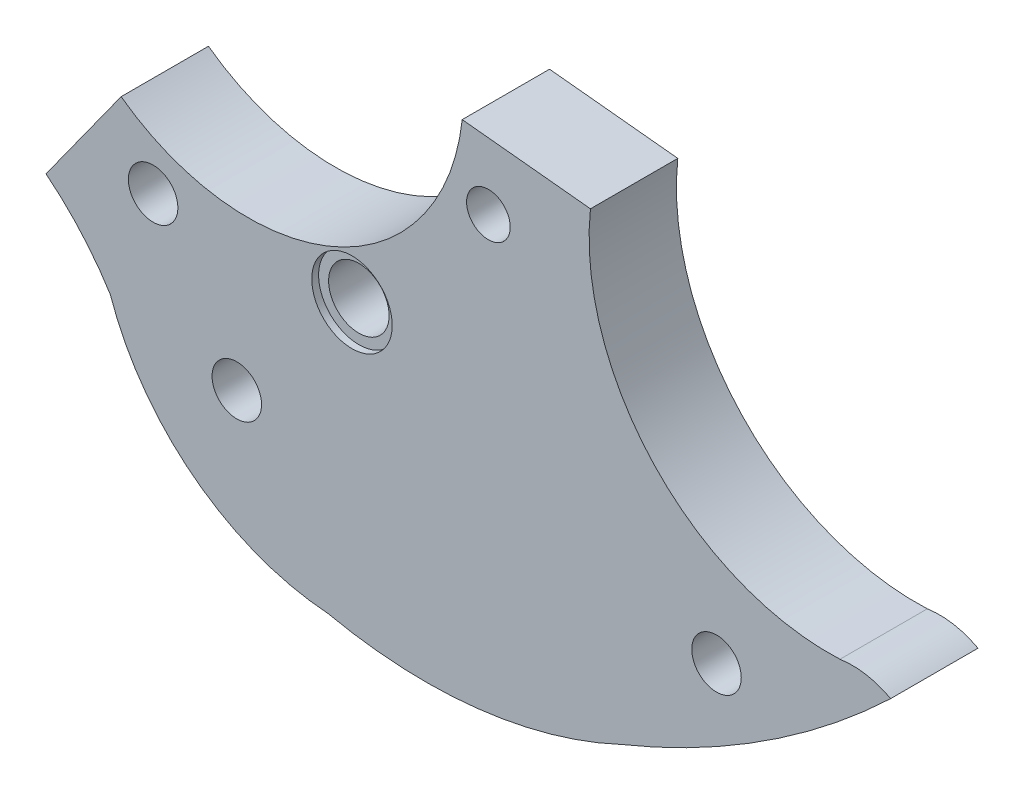
ISO-10303-21;
HEADER;
FILE_DESCRIPTION(('STEP AP214'),'2;1');
FILE_NAME('part.step','',(''),(''),'','','');
FILE_SCHEMA(('AUTOMOTIVE_DESIGN { 1 0 10303 214 1 1 1 1 }'));
ENDSEC;
DATA;
#1=APPLICATION_CONTEXT('core data for automotive mechanical design processes');
#2=APPLICATION_PROTOCOL_DEFINITION('international standard','automotive_design',2000,#1);
#3=PRODUCT_CONTEXT('',#1,'mechanical');
#4=PRODUCT('Part','Part','',(#3));
#5=PRODUCT_RELATED_PRODUCT_CATEGORY('part','',(#4));
#6=PRODUCT_DEFINITION_FORMATION('','',#4);
#7=PRODUCT_DEFINITION_CONTEXT('part definition',#1,'design');
#8=PRODUCT_DEFINITION('design','',#6,#7);
#9=PRODUCT_DEFINITION_SHAPE('','',#8);
#10=(LENGTH_UNIT() NAMED_UNIT(*) SI_UNIT(.MILLI.,.METRE.));
#11=(NAMED_UNIT(*) PLANE_ANGLE_UNIT() SI_UNIT($,.RADIAN.));
#12=(NAMED_UNIT(*) SI_UNIT($,.STERADIAN.) SOLID_ANGLE_UNIT());
#13=UNCERTAINTY_MEASURE_WITH_UNIT(LENGTH_MEASURE(1.E-05),#10,'distance_accuracy_value','');
#14=(GEOMETRIC_REPRESENTATION_CONTEXT(3) GLOBAL_UNCERTAINTY_ASSIGNED_CONTEXT((#13)) GLOBAL_UNIT_ASSIGNED_CONTEXT((#10,
#11,#12)) REPRESENTATION_CONTEXT('',''));
#15=CARTESIAN_POINT('',(0.,0.,0.));
#16=DIRECTION('',(0.,0.,1.));
#17=DIRECTION('',(1.,0.,0.));
#18=AXIS2_PLACEMENT_3D('',#15,#16,#17);
#19=CARTESIAN_POINT('',(52.2343020464871,49.4576694571412,12.7));
#20=DIRECTION('',(0.,0.,-1.));
#21=DIRECTION('',(-1.,0.,0.));
#22=AXIS2_PLACEMENT_3D('',#19,#20,#21);
#23=CYLINDRICAL_SURFACE('',#22,4.4);
#24=CARTESIAN_POINT('',(52.2343020464871,49.4576694571412,0.));
#25=DIRECTION('',(0.,0.,1.));
#26=DIRECTION('',(1.,0.,0.));
#27=AXIS2_PLACEMENT_3D('',#24,#25,#26);
#28=CIRCLE('',#27,4.4);
#29=CARTESIAN_POINT('',(56.6343020464871,49.4576694571412,0.));
#30=VERTEX_POINT('',#29);
#31=EDGE_CURVE('E259',#30,#30,#28,.T.);
#32=ORIENTED_EDGE('',*,*,#31,.F.);
#33=EDGE_LOOP('',(#32));
#34=FACE_BOUND('',#33,.T.);
#35=CARTESIAN_POINT('',(52.2343020464871,49.4576694571412,11.7));
#36=DIRECTION('',(0.,0.,1.));
#37=DIRECTION('',(1.,0.,0.));
#38=AXIS2_PLACEMENT_3D('',#35,#36,#37);
#39=CIRCLE('',#38,4.4);
#40=CARTESIAN_POINT('',(56.6343020464871,49.4576694571412,11.7));
#41=VERTEX_POINT('',#40);
#42=EDGE_CURVE('E43',#41,#41,#39,.T.);
#43=ORIENTED_EDGE('',*,*,#42,.T.);
#44=EDGE_LOOP('',(#43));
#45=FACE_BOUND('',#44,.T.);
#46=ADVANCED_FACE('F39',(#34,#45),#23,.F.);
#47=CARTESIAN_POINT('',(37.1253879159266,83.8639846444566,12.7));
#48=DIRECTION('',(0.,0.,1.));
#49=DIRECTION('',(1.,0.,0.));
#50=AXIS2_PLACEMENT_3D('',#47,#48,#49);
#51=PLANE('',#50);
#52=CARTESIAN_POINT('',(52.2343020464871,49.4576694571412,12.7));
#53=DIRECTION('',(0.,0.,1.));
#54=DIRECTION('',(1.,0.,0.));
#55=AXIS2_PLACEMENT_3D('',#52,#53,#54);
#56=CIRCLE('',#55,5.85);
#57=CARTESIAN_POINT('',(58.0843020464871,49.4576694571412,12.7));
#58=VERTEX_POINT('',#57);
#59=EDGE_CURVE('E266',#58,#58,#56,.T.);
#60=ORIENTED_EDGE('',*,*,#59,.F.);
#61=EDGE_LOOP('',(#60));
#62=FACE_BOUND('',#61,.T.);
#63=CARTESIAN_POINT('',(105.243732184304,30.4641441405667,12.7));
#64=DIRECTION('',(0.,0.,1.));
#65=DIRECTION('',(1.,0.,0.));
#66=AXIS2_PLACEMENT_3D('',#63,#64,#65);
#67=CIRCLE('',#66,3.6);
#68=CARTESIAN_POINT('',(108.843732184304,30.4641441405667,12.7));
#69=VERTEX_POINT('',#68);
#70=EDGE_CURVE('E251',#69,#69,#67,.T.);
#71=ORIENTED_EDGE('',*,*,#70,.F.);
#72=EDGE_LOOP('',(#71));
#73=FACE_BOUND('',#72,.T.);
#74=CARTESIAN_POINT('',(23.3182900497723,48.6789641382707,12.7));
#75=DIRECTION('',(0.,0.,1.));
#76=DIRECTION('',(1.,0.,0.));
#77=AXIS2_PLACEMENT_3D('',#74,#75,#76);
#78=CIRCLE('',#77,3.6);
#79=CARTESIAN_POINT('',(26.9182900497723,48.6789641382707,12.7));
#80=VERTEX_POINT('',#79);
#81=EDGE_CURVE('E235',#80,#80,#78,.T.);
#82=ORIENTED_EDGE('',*,*,#81,.F.);
#83=EDGE_LOOP('',(#82));
#84=FACE_BOUND('',#83,.T.);
#85=CARTESIAN_POINT('',(37.1253879159266,83.8639846444566,12.7));
#86=DIRECTION('',(0.,0.,-1.));
#87=DIRECTION('',(1.,0.,0.));
#88=AXIS2_PLACEMENT_3D('',#85,#86,#87);
#89=CIRCLE('',#88,31.322900316363);
#90=CARTESIAN_POINT('',(68.2640297264696,80.4714825555087,12.7));
#91=VERTEX_POINT('',#90);
#92=CARTESIAN_POINT('',(18.6636008619195,58.5601014839354,12.7));
#93=VERTEX_POINT('',#92);
#94=EDGE_CURVE('E175',#91,#93,#89,.T.);
#95=ORIENTED_EDGE('',*,*,#94,.T.);
#96=DIRECTION('',(-0.584092787225735,-0.811686895244017,0.));
#97=VECTOR('',#96,1.);
#98=CARTESIAN_POINT('',(7.7409802244119,43.3814377046814,12.7));
#99=LINE('',#98,#97);
#100=CARTESIAN_POINT('',(7.7409802244119,43.3814377046814,12.7));
#101=VERTEX_POINT('',#100);
#102=EDGE_CURVE('E104',#93,#101,#99,.T.);
#103=ORIENTED_EDGE('',*,*,#102,.T.);
#104=CARTESIAN_POINT('',(-18.333321031147,10.7859474439337,12.7));
#105=DIRECTION('',(0.,0.,-1.));
#106=DIRECTION('',(1.,0.,0.));
#107=AXIS2_PLACEMENT_3D('',#104,#105,#106);
#108=CIRCLE('',#107,41.7412885678454);
#109=CARTESIAN_POINT('',(17.091631159214,32.8632646182368,12.7));
#110=VERTEX_POINT('',#109);
#111=EDGE_CURVE('E201',#101,#110,#108,.T.);
#112=ORIENTED_EDGE('',*,*,#111,.T.);
#113=CARTESIAN_POINT('',(51.3918564850536,44.6963143264845,12.7));
#114=DIRECTION('',(0.,0.,1.));
#115=DIRECTION('',(1.,0.,0.));
#116=AXIS2_PLACEMENT_3D('',#113,#114,#115);
#117=CIRCLE('',#116,36.2839706041281);
#118=CARTESIAN_POINT('',(48.7852979136686,8.50608946927794,12.7));
#119=VERTEX_POINT('',#118);
#120=EDGE_CURVE('E219',#110,#119,#117,.T.);
#121=ORIENTED_EDGE('',*,*,#120,.T.);
#122=CARTESIAN_POINT('',(62.93038116209,73.9848714735547,12.7));
#123=DIRECTION('',(0.,0.,1.));
#124=DIRECTION('',(1.,0.,0.));
#125=AXIS2_PLACEMENT_3D('',#122,#123,#124);
#126=CIRCLE('',#125,66.9892101227382);
#127=CARTESIAN_POINT('',(91.4216859607616,13.3564967325346,12.7));
#128=VERTEX_POINT('',#127);
#129=EDGE_CURVE('E217',#119,#128,#126,.T.);
#130=ORIENTED_EDGE('',*,*,#129,.T.);
#131=CARTESIAN_POINT('',(44.4653107743594,128.776509479846,12.7));
#132=DIRECTION('',(0.,0.,1.));
#133=DIRECTION('',(1.,0.,0.));
#134=AXIS2_PLACEMENT_3D('',#131,#132,#133);
#135=CIRCLE('',#134,124.606101428605);
#136=CARTESIAN_POINT('',(130.568554451859,38.7048050358374,12.7));
#137=VERTEX_POINT('',#136);
#138=EDGE_CURVE('E127',#128,#137,#135,.T.);
#139=ORIENTED_EDGE('',*,*,#138,.T.);
#140=CARTESIAN_POINT('',(124.978643697181,28.3368703837209,12.7));
#141=DIRECTION('',(0.,0.,1.));
#142=DIRECTION('',(1.,0.,0.));
#143=AXIS2_PLACEMENT_3D('',#140,#141,#142);
#144=CIRCLE('',#143,11.7788442215621);
#145=CARTESIAN_POINT('',(123.199407881085,39.9805592797088,12.7));
#146=VERTEX_POINT('',#145);
#147=EDGE_CURVE('E120',#137,#146,#144,.T.);
#148=ORIENTED_EDGE('',*,*,#147,.T.);
#149=CARTESIAN_POINT('',(121.612132230608,74.842006611136,12.7));
#150=DIRECTION('',(0.,0.,-1.));
#151=DIRECTION('',(1.,0.,0.));
#152=AXIS2_PLACEMENT_3D('',#149,#150,#151);
#153=CIRCLE('',#152,34.8975637263187);
#154=CARTESIAN_POINT('',(86.9137187089322,78.5649158379707,12.7));
#155=VERTEX_POINT('',#154);
#156=EDGE_CURVE('E125',#146,#155,#153,.T.);
#157=ORIENTED_EDGE('',*,*,#156,.T.);
#158=DIRECTION('',(-0.994815069990102,0.101700425370736,0.));
#159=VECTOR('',#158,1.);
#160=CARTESIAN_POINT('',(68.2640297264696,80.4714825555087,12.7));
#161=LINE('',#160,#159);
#162=EDGE_CURVE('E58',#155,#91,#161,.T.);
#163=ORIENTED_EDGE('',*,*,#162,.T.);
#164=EDGE_LOOP('',(#95,#103,#112,#121,#130,#139,#148,#157,#163));
#165=FACE_BOUND('',#164,.T.);
#166=CARTESIAN_POINT('',(72.0734393800084,70.4201259458292,12.7));
#167=DIRECTION('',(0.,0.,1.));
#168=DIRECTION('',(1.,0.,0.));
#169=AXIS2_PLACEMENT_3D('',#166,#167,#168);
#170=CIRCLE('',#169,3.175);
#171=CARTESIAN_POINT('',(75.2484393800084,70.4201259458292,12.7));
#172=VERTEX_POINT('',#171);
#173=EDGE_CURVE('E154',#172,#172,#170,.T.);
#174=ORIENTED_EDGE('',*,*,#173,.F.);
#175=EDGE_LOOP('',(#174));
#176=FACE_BOUND('',#175,.T.);
#177=CARTESIAN_POINT('',(35.4864956833077,29.9885482493761,12.7));
#178=DIRECTION('',(0.,0.,1.));
#179=DIRECTION('',(1.,0.,0.));
#180=AXIS2_PLACEMENT_3D('',#177,#178,#179);
#181=CIRCLE('',#180,3.6);
#182=CARTESIAN_POINT('',(39.0864956833077,29.9885482493761,12.7));
#183=VERTEX_POINT('',#182);
#184=EDGE_CURVE('E243',#183,#183,#181,.T.);
#185=ORIENTED_EDGE('',*,*,#184,.F.);
#186=EDGE_LOOP('',(#185));
#187=FACE_BOUND('',#186,.T.);
#188=ADVANCED_FACE('F122',(#62,#73,#84,#165,#176,#187),#51,.T.);
#189=CARTESIAN_POINT('',(37.1253879159266,83.8639846444566,0.));
#190=DIRECTION('',(0.,0.,1.));
#191=DIRECTION('',(1.,0.,0.));
#192=AXIS2_PLACEMENT_3D('',#189,#190,#191);
#193=PLANE('',#192);
#194=CARTESIAN_POINT('',(37.1253879159266,83.8639846444566,0.));
#195=DIRECTION('',(0.,0.,-1.));
#196=DIRECTION('',(1.,0.,0.));
#197=AXIS2_PLACEMENT_3D('',#194,#195,#196);
#198=CIRCLE('',#197,31.322900316363);
#199=CARTESIAN_POINT('',(68.2640297264696,80.4714825555087,0.));
#200=VERTEX_POINT('',#199);
#201=CARTESIAN_POINT('',(18.6636008619195,58.5601014839354,0.));
#202=VERTEX_POINT('',#201);
#203=EDGE_CURVE('E149',#200,#202,#198,.T.);
#204=ORIENTED_EDGE('',*,*,#203,.F.);
#205=DIRECTION('',(-0.994815069990102,0.101700425370736,0.));
#206=VECTOR('',#205,1.);
#207=CARTESIAN_POINT('',(68.2640297264696,80.4714825555087,0.));
#208=LINE('',#207,#206);
#209=CARTESIAN_POINT('',(86.9137187089322,78.5649158379707,0.));
#210=VERTEX_POINT('',#209);
#211=EDGE_CURVE('E96',#210,#200,#208,.T.);
#212=ORIENTED_EDGE('',*,*,#211,.F.);
#213=CARTESIAN_POINT('',(121.612132230608,74.842006611136,0.));
#214=DIRECTION('',(0.,0.,-1.));
#215=DIRECTION('',(1.,0.,0.));
#216=AXIS2_PLACEMENT_3D('',#213,#214,#215);
#217=CIRCLE('',#216,34.8975637263187);
#218=CARTESIAN_POINT('',(123.199407881085,39.9805592797088,0.));
#219=VERTEX_POINT('',#218);
#220=EDGE_CURVE('E90',#219,#210,#217,.T.);
#221=ORIENTED_EDGE('',*,*,#220,.F.);
#222=CARTESIAN_POINT('',(124.978643697181,28.3368703837209,0.));
#223=DIRECTION('',(0.,0.,1.));
#224=DIRECTION('',(1.,0.,0.));
#225=AXIS2_PLACEMENT_3D('',#222,#223,#224);
#226=CIRCLE('',#225,11.7788442215621);
#227=CARTESIAN_POINT('',(130.568554451859,38.7048050358374,0.));
#228=VERTEX_POINT('',#227);
#229=EDGE_CURVE('E136',#228,#219,#226,.T.);
#230=ORIENTED_EDGE('',*,*,#229,.F.);
#231=CARTESIAN_POINT('',(44.4653107743594,128.776509479846,0.));
#232=DIRECTION('',(0.,0.,1.));
#233=DIRECTION('',(1.,0.,0.));
#234=AXIS2_PLACEMENT_3D('',#231,#232,#233);
#235=CIRCLE('',#234,124.606101428605);
#236=CARTESIAN_POINT('',(91.4216859607616,13.3564967325346,0.));
#237=VERTEX_POINT('',#236);
#238=EDGE_CURVE('E166',#237,#228,#235,.T.);
#239=ORIENTED_EDGE('',*,*,#238,.F.);
#240=CARTESIAN_POINT('',(62.93038116209,73.9848714735547,0.));
#241=DIRECTION('',(0.,0.,1.));
#242=DIRECTION('',(1.,0.,0.));
#243=AXIS2_PLACEMENT_3D('',#240,#241,#242);
#244=CIRCLE('',#243,66.9892101227382);
#245=CARTESIAN_POINT('',(48.7852979136686,8.50608946927794,0.));
#246=VERTEX_POINT('',#245);
#247=EDGE_CURVE('E163',#246,#237,#244,.T.);
#248=ORIENTED_EDGE('',*,*,#247,.F.);
#249=CARTESIAN_POINT('',(51.3918564850536,44.6963143264845,0.));
#250=DIRECTION('',(0.,0.,1.));
#251=DIRECTION('',(1.,0.,0.));
#252=AXIS2_PLACEMENT_3D('',#249,#250,#251);
#253=CIRCLE('',#252,36.2839706041281);
#254=CARTESIAN_POINT('',(17.091631159214,32.8632646182368,0.));
#255=VERTEX_POINT('',#254);
#256=EDGE_CURVE('E160',#255,#246,#253,.T.);
#257=ORIENTED_EDGE('',*,*,#256,.F.);
#258=CARTESIAN_POINT('',(-18.333321031147,10.7859474439337,0.));
#259=DIRECTION('',(0.,0.,-1.));
#260=DIRECTION('',(1.,0.,0.));
#261=AXIS2_PLACEMENT_3D('',#258,#259,#260);
#262=CIRCLE('',#261,41.7412885678454);
#263=CARTESIAN_POINT('',(7.7409802244119,43.3814377046814,0.));
#264=VERTEX_POINT('',#263);
#265=EDGE_CURVE('E157',#264,#255,#262,.T.);
#266=ORIENTED_EDGE('',*,*,#265,.F.);
#267=DIRECTION('',(-0.584092787225735,-0.811686895244017,0.));
#268=VECTOR('',#267,1.);
#269=CARTESIAN_POINT('',(7.7409802244119,43.3814377046814,0.));
#270=LINE('',#269,#268);
#271=EDGE_CURVE('E153',#202,#264,#270,.T.);
#272=ORIENTED_EDGE('',*,*,#271,.F.);
#273=EDGE_LOOP('',(#204,#212,#221,#230,#239,#248,#257,#266,#272));
#274=FACE_BOUND('',#273,.T.);
#275=CARTESIAN_POINT('',(72.0734393800084,70.4201259458292,0.));
#276=DIRECTION('',(0.,0.,1.));
#277=DIRECTION('',(1.,0.,0.));
#278=AXIS2_PLACEMENT_3D('',#275,#276,#277);
#279=CIRCLE('',#278,3.175);
#280=CARTESIAN_POINT('',(75.2484393800084,70.4201259458292,0.));
#281=VERTEX_POINT('',#280);
#282=EDGE_CURVE('E231',#281,#281,#279,.T.);
#283=ORIENTED_EDGE('',*,*,#282,.T.);
#284=EDGE_LOOP('',(#283));
#285=FACE_BOUND('',#284,.T.);
#286=CARTESIAN_POINT('',(23.3182900497723,48.6789641382707,0.));
#287=DIRECTION('',(0.,0.,1.));
#288=DIRECTION('',(1.,0.,0.));
#289=AXIS2_PLACEMENT_3D('',#286,#287,#288);
#290=CIRCLE('',#289,3.6);
#291=CARTESIAN_POINT('',(26.9182900497723,48.6789641382707,0.));
#292=VERTEX_POINT('',#291);
#293=EDGE_CURVE('E239',#292,#292,#290,.T.);
#294=ORIENTED_EDGE('',*,*,#293,.T.);
#295=EDGE_LOOP('',(#294));
#296=FACE_BOUND('',#295,.T.);
#297=CARTESIAN_POINT('',(35.4864956833077,29.9885482493761,0.));
#298=DIRECTION('',(0.,0.,1.));
#299=DIRECTION('',(1.,0.,0.));
#300=AXIS2_PLACEMENT_3D('',#297,#298,#299);
#301=CIRCLE('',#300,3.6);
#302=CARTESIAN_POINT('',(39.0864956833077,29.9885482493761,0.));
#303=VERTEX_POINT('',#302);
#304=EDGE_CURVE('E247',#303,#303,#301,.T.);
#305=ORIENTED_EDGE('',*,*,#304,.T.);
#306=EDGE_LOOP('',(#305));
#307=FACE_BOUND('',#306,.T.);
#308=CARTESIAN_POINT('',(105.243732184304,30.4641441405667,0.));
#309=DIRECTION('',(0.,0.,1.));
#310=DIRECTION('',(1.,0.,0.));
#311=AXIS2_PLACEMENT_3D('',#308,#309,#310);
#312=CIRCLE('',#311,3.6);
#313=CARTESIAN_POINT('',(108.843732184304,30.4641441405667,0.));
#314=VERTEX_POINT('',#313);
#315=EDGE_CURVE('E255',#314,#314,#312,.T.);
#316=ORIENTED_EDGE('',*,*,#315,.T.);
#317=EDGE_LOOP('',(#316));
#318=FACE_BOUND('',#317,.T.);
#319=ORIENTED_EDGE('',*,*,#31,.T.);
#320=EDGE_LOOP('',(#319));
#321=FACE_BOUND('',#320,.T.);
#322=ADVANCED_FACE('F205',(#274,#285,#296,#307,#318,#321),#193,.F.);
#323=CARTESIAN_POINT('',(37.1253879159266,83.8639846444566,12.7));
#324=DIRECTION('',(0.,0.,-1.));
#325=DIRECTION('',(-1.,0.,0.));
#326=AXIS2_PLACEMENT_3D('',#323,#324,#325);
#327=CYLINDRICAL_SURFACE('',#326,31.322900316363);
#328=ORIENTED_EDGE('',*,*,#203,.T.);
#329=DIRECTION('',(0.,0.,-1.));
#330=VECTOR('',#329,1.);
#331=CARTESIAN_POINT('',(18.6636008619195,58.5601014839354,12.7));
#332=LINE('',#331,#330);
#333=EDGE_CURVE('E11',#93,#202,#332,.T.);
#334=ORIENTED_EDGE('',*,*,#333,.F.);
#335=ORIENTED_EDGE('',*,*,#94,.F.);
#336=DIRECTION('',(0.,0.,-1.));
#337=VECTOR('',#336,1.);
#338=CARTESIAN_POINT('',(68.2640297264696,80.4714825555087,12.7));
#339=LINE('',#338,#337);
#340=EDGE_CURVE('E145',#91,#200,#339,.T.);
#341=ORIENTED_EDGE('',*,*,#340,.T.);
#342=EDGE_LOOP('',(#328,#334,#335,#341));
#343=FACE_BOUND('',#342,.T.);
#344=ADVANCED_FACE('F41',(#343),#327,.F.);
#345=CARTESIAN_POINT('',(7.7409802244119,43.3814377046814,12.7));
#346=DIRECTION('',(0.811686895244017,-0.584092787225735,0.));
#347=DIRECTION('',(0.584092787225735,0.811686895244017,0.));
#348=AXIS2_PLACEMENT_3D('',#345,#346,#347);
#349=PLANE('',#348);
#350=ORIENTED_EDGE('',*,*,#271,.T.);
#351=DIRECTION('',(0.,0.,-1.));
#352=VECTOR('',#351,1.);
#353=CARTESIAN_POINT('',(7.7409802244119,43.3814377046814,12.7));
#354=LINE('',#353,#352);
#355=EDGE_CURVE('E50',#101,#264,#354,.T.);
#356=ORIENTED_EDGE('',*,*,#355,.F.);
#357=ORIENTED_EDGE('',*,*,#102,.F.);
#358=ORIENTED_EDGE('',*,*,#333,.T.);
#359=EDGE_LOOP('',(#350,#356,#357,#358));
#360=FACE_BOUND('',#359,.T.);
#361=ADVANCED_FACE('F333',(#360),#349,.F.);
#362=CARTESIAN_POINT('',(-18.333321031147,10.7859474439337,12.7));
#363=DIRECTION('',(0.,0.,-1.));
#364=DIRECTION('',(-1.,0.,0.));
#365=AXIS2_PLACEMENT_3D('',#362,#363,#364);
#366=CYLINDRICAL_SURFACE('',#365,41.7412885678454);
#367=ORIENTED_EDGE('',*,*,#265,.T.);
#368=DIRECTION('',(0.,0.,-1.));
#369=VECTOR('',#368,1.);
#370=CARTESIAN_POINT('',(17.091631159214,32.8632646182368,12.7));
#371=LINE('',#370,#369);
#372=EDGE_CURVE('E190',#110,#255,#371,.T.);
#373=ORIENTED_EDGE('',*,*,#372,.F.);
#374=ORIENTED_EDGE('',*,*,#111,.F.);
#375=ORIENTED_EDGE('',*,*,#355,.T.);
#376=EDGE_LOOP('',(#367,#373,#374,#375));
#377=FACE_BOUND('',#376,.T.);
#378=ADVANCED_FACE('F199',(#377),#366,.F.);
#379=CARTESIAN_POINT('',(51.3918564850536,44.6963143264845,12.7));
#380=DIRECTION('',(0.,0.,-1.));
#381=DIRECTION('',(-1.,0.,0.));
#382=AXIS2_PLACEMENT_3D('',#379,#380,#381);
#383=CYLINDRICAL_SURFACE('',#382,36.2839706041281);
#384=ORIENTED_EDGE('',*,*,#256,.T.);
#385=DIRECTION('',(0.,0.,-1.));
#386=VECTOR('',#385,1.);
#387=CARTESIAN_POINT('',(48.7852979136686,8.50608946927794,12.7));
#388=LINE('',#387,#386);
#389=EDGE_CURVE('E186',#119,#246,#388,.T.);
#390=ORIENTED_EDGE('',*,*,#389,.F.);
#391=ORIENTED_EDGE('',*,*,#120,.F.);
#392=ORIENTED_EDGE('',*,*,#372,.T.);
#393=EDGE_LOOP('',(#384,#390,#391,#392));
#394=FACE_BOUND('',#393,.T.);
#395=ADVANCED_FACE('F211',(#394),#383,.T.);
#396=CARTESIAN_POINT('',(62.93038116209,73.9848714735547,12.7));
#397=DIRECTION('',(0.,0.,-1.));
#398=DIRECTION('',(-1.,0.,0.));
#399=AXIS2_PLACEMENT_3D('',#396,#397,#398);
#400=CYLINDRICAL_SURFACE('',#399,66.9892101227382);
#401=ORIENTED_EDGE('',*,*,#247,.T.);
#402=DIRECTION('',(0.,0.,-1.));
#403=VECTOR('',#402,1.);
#404=CARTESIAN_POINT('',(91.4216859607616,13.3564967325346,12.7));
#405=LINE('',#404,#403);
#406=EDGE_CURVE('E182',#128,#237,#405,.T.);
#407=ORIENTED_EDGE('',*,*,#406,.F.);
#408=ORIENTED_EDGE('',*,*,#129,.F.);
#409=ORIENTED_EDGE('',*,*,#389,.T.);
#410=EDGE_LOOP('',(#401,#407,#408,#409));
#411=FACE_BOUND('',#410,.T.);
#412=ADVANCED_FACE('F215',(#411),#400,.T.);
#413=CARTESIAN_POINT('',(44.4653107743594,128.776509479846,12.7));
#414=DIRECTION('',(0.,0.,-1.));
#415=DIRECTION('',(-1.,0.,0.));
#416=AXIS2_PLACEMENT_3D('',#413,#414,#415);
#417=CYLINDRICAL_SURFACE('',#416,124.606101428605);
#418=ORIENTED_EDGE('',*,*,#238,.T.);
#419=DIRECTION('',(0.,0.,-1.));
#420=VECTOR('',#419,1.);
#421=CARTESIAN_POINT('',(130.568554451859,38.7048050358374,12.7));
#422=LINE('',#421,#420);
#423=EDGE_CURVE('E138',#137,#228,#422,.T.);
#424=ORIENTED_EDGE('',*,*,#423,.F.);
#425=ORIENTED_EDGE('',*,*,#138,.F.);
#426=ORIENTED_EDGE('',*,*,#406,.T.);
#427=EDGE_LOOP('',(#418,#424,#425,#426));
#428=FACE_BOUND('',#427,.T.);
#429=ADVANCED_FACE('F324',(#428),#417,.T.);
#430=CARTESIAN_POINT('',(124.978643697181,28.3368703837209,12.7));
#431=DIRECTION('',(0.,0.,-1.));
#432=DIRECTION('',(-1.,0.,0.));
#433=AXIS2_PLACEMENT_3D('',#430,#431,#432);
#434=CYLINDRICAL_SURFACE('',#433,11.7788442215621);
#435=ORIENTED_EDGE('',*,*,#229,.T.);
#436=DIRECTION('',(0.,0.,-1.));
#437=VECTOR('',#436,1.);
#438=CARTESIAN_POINT('',(123.199407881085,39.9805592797088,12.7));
#439=LINE('',#438,#437);
#440=EDGE_CURVE('E133',#146,#219,#439,.T.);
#441=ORIENTED_EDGE('',*,*,#440,.F.);
#442=ORIENTED_EDGE('',*,*,#147,.F.);
#443=ORIENTED_EDGE('',*,*,#423,.T.);
#444=EDGE_LOOP('',(#435,#441,#442,#443));
#445=FACE_BOUND('',#444,.T.);
#446=ADVANCED_FACE('F134',(#445),#434,.T.);
#447=CARTESIAN_POINT('',(121.612132230608,74.842006611136,12.7));
#448=DIRECTION('',(0.,0.,-1.));
#449=DIRECTION('',(-1.,0.,0.));
#450=AXIS2_PLACEMENT_3D('',#447,#448,#449);
#451=CYLINDRICAL_SURFACE('',#450,34.8975637263187);
#452=ORIENTED_EDGE('',*,*,#220,.T.);
#453=DIRECTION('',(0.,0.,-1.));
#454=VECTOR('',#453,1.);
#455=CARTESIAN_POINT('',(86.9137187089322,78.5649158379707,12.7));
#456=LINE('',#455,#454);
#457=EDGE_CURVE('E139',#155,#210,#456,.T.);
#458=ORIENTED_EDGE('',*,*,#457,.F.);
#459=ORIENTED_EDGE('',*,*,#156,.F.);
#460=ORIENTED_EDGE('',*,*,#440,.T.);
#461=EDGE_LOOP('',(#452,#458,#459,#460));
#462=FACE_BOUND('',#461,.T.);
#463=ADVANCED_FACE('F141',(#462),#451,.F.);
#464=CARTESIAN_POINT('',(68.2640297264696,80.4714825555087,12.7));
#465=DIRECTION('',(-0.101700425370736,-0.994815069990102,0.));
#466=DIRECTION('',(0.994815069990102,-0.101700425370736,0.));
#467=AXIS2_PLACEMENT_3D('',#464,#465,#466);
#468=PLANE('',#467);
#469=ORIENTED_EDGE('',*,*,#211,.T.);
#470=ORIENTED_EDGE('',*,*,#340,.F.);
#471=ORIENTED_EDGE('',*,*,#162,.F.);
#472=ORIENTED_EDGE('',*,*,#457,.T.);
#473=EDGE_LOOP('',(#469,#470,#471,#472));
#474=FACE_BOUND('',#473,.T.);
#475=ADVANCED_FACE('F313',(#474),#468,.F.);
#476=CARTESIAN_POINT('',(72.0734393800084,70.4201259458292,12.7));
#477=DIRECTION('',(0.,0.,-1.));
#478=DIRECTION('',(-1.,0.,0.));
#479=AXIS2_PLACEMENT_3D('',#476,#477,#478);
#480=CYLINDRICAL_SURFACE('',#479,3.175);
#481=ORIENTED_EDGE('',*,*,#173,.T.);
#482=EDGE_LOOP('',(#481));
#483=FACE_BOUND('',#482,.T.);
#484=ORIENTED_EDGE('',*,*,#282,.F.);
#485=EDGE_LOOP('',(#484));
#486=FACE_BOUND('',#485,.T.);
#487=ADVANCED_FACE('F310',(#483,#486),#480,.F.);
#488=CARTESIAN_POINT('',(23.3182900497723,48.6789641382707,12.7));
#489=DIRECTION('',(0.,0.,-1.));
#490=DIRECTION('',(-1.,0.,0.));
#491=AXIS2_PLACEMENT_3D('',#488,#489,#490);
#492=CYLINDRICAL_SURFACE('',#491,3.6);
#493=ORIENTED_EDGE('',*,*,#81,.T.);
#494=EDGE_LOOP('',(#493));
#495=FACE_BOUND('',#494,.T.);
#496=ORIENTED_EDGE('',*,*,#293,.F.);
#497=EDGE_LOOP('',(#496));
#498=FACE_BOUND('',#497,.T.);
#499=ADVANCED_FACE('F306',(#495,#498),#492,.F.);
#500=CARTESIAN_POINT('',(35.4864956833077,29.9885482493761,12.7));
#501=DIRECTION('',(0.,0.,-1.));
#502=DIRECTION('',(-1.,0.,0.));
#503=AXIS2_PLACEMENT_3D('',#500,#501,#502);
#504=CYLINDRICAL_SURFACE('',#503,3.6);
#505=ORIENTED_EDGE('',*,*,#184,.T.);
#506=EDGE_LOOP('',(#505));
#507=FACE_BOUND('',#506,.T.);
#508=ORIENTED_EDGE('',*,*,#304,.F.);
#509=EDGE_LOOP('',(#508));
#510=FACE_BOUND('',#509,.T.);
#511=ADVANCED_FACE('F302',(#507,#510),#504,.F.);
#512=CARTESIAN_POINT('',(105.243732184304,30.4641441405667,12.7));
#513=DIRECTION('',(0.,0.,-1.));
#514=DIRECTION('',(-1.,0.,0.));
#515=AXIS2_PLACEMENT_3D('',#512,#513,#514);
#516=CYLINDRICAL_SURFACE('',#515,3.6);
#517=ORIENTED_EDGE('',*,*,#70,.T.);
#518=EDGE_LOOP('',(#517));
#519=FACE_BOUND('',#518,.T.);
#520=ORIENTED_EDGE('',*,*,#315,.F.);
#521=EDGE_LOOP('',(#520));
#522=FACE_BOUND('',#521,.T.);
#523=ADVANCED_FACE('F287',(#519,#522),#516,.F.);
#524=CARTESIAN_POINT('',(52.2343020464871,49.4576694571412,11.7));
#525=DIRECTION('',(0.,0.,1.));
#526=DIRECTION('',(1.,0.,0.));
#527=AXIS2_PLACEMENT_3D('',#524,#525,#526);
#528=CYLINDRICAL_SURFACE('',#527,5.85);
#529=CARTESIAN_POINT('',(52.2343020464871,49.4576694571412,11.7));
#530=DIRECTION('',(0.,0.,1.));
#531=DIRECTION('',(1.,0.,0.));
#532=AXIS2_PLACEMENT_3D('',#529,#530,#531);
#533=CIRCLE('',#532,5.85);
#534=CARTESIAN_POINT('',(58.0843020464871,49.4576694571412,11.7));
#535=VERTEX_POINT('',#534);
#536=EDGE_CURVE('E270',#535,#535,#533,.T.);
#537=ORIENTED_EDGE('',*,*,#536,.F.);
#538=EDGE_LOOP('',(#537));
#539=FACE_BOUND('',#538,.T.);
#540=ORIENTED_EDGE('',*,*,#59,.T.);
#541=EDGE_LOOP('',(#540));
#542=FACE_BOUND('',#541,.T.);
#543=ADVANCED_FACE('F282',(#539,#542),#528,.F.);
#544=CARTESIAN_POINT('',(52.2343020464871,49.4576694571412,11.7));
#545=DIRECTION('',(0.,0.,1.));
#546=DIRECTION('',(1.,0.,0.));
#547=AXIS2_PLACEMENT_3D('',#544,#545,#546);
#548=PLANE('',#547);
#549=ORIENTED_EDGE('',*,*,#42,.F.);
#550=EDGE_LOOP('',(#549));
#551=FACE_BOUND('',#550,.T.);
#552=ORIENTED_EDGE('',*,*,#536,.T.);
#553=EDGE_LOOP('',(#552));
#554=FACE_BOUND('',#553,.T.);
#555=ADVANCED_FACE('F280',(#551,#554),#548,.T.);
#556=CLOSED_SHELL('',(#46,#188,#322,#344,#361,#378,#395,#412,#429,#446,#463,#475,#487,#499,#511,
#523,#543,#555));
#557=MANIFOLD_SOLID_BREP('B2',#556);
#558=ADVANCED_BREP_SHAPE_REPRESENTATION('',(#18,#557),#14);
#559=SHAPE_DEFINITION_REPRESENTATION(#9,#558);
ENDSEC;
END-ISO-10303-21;
